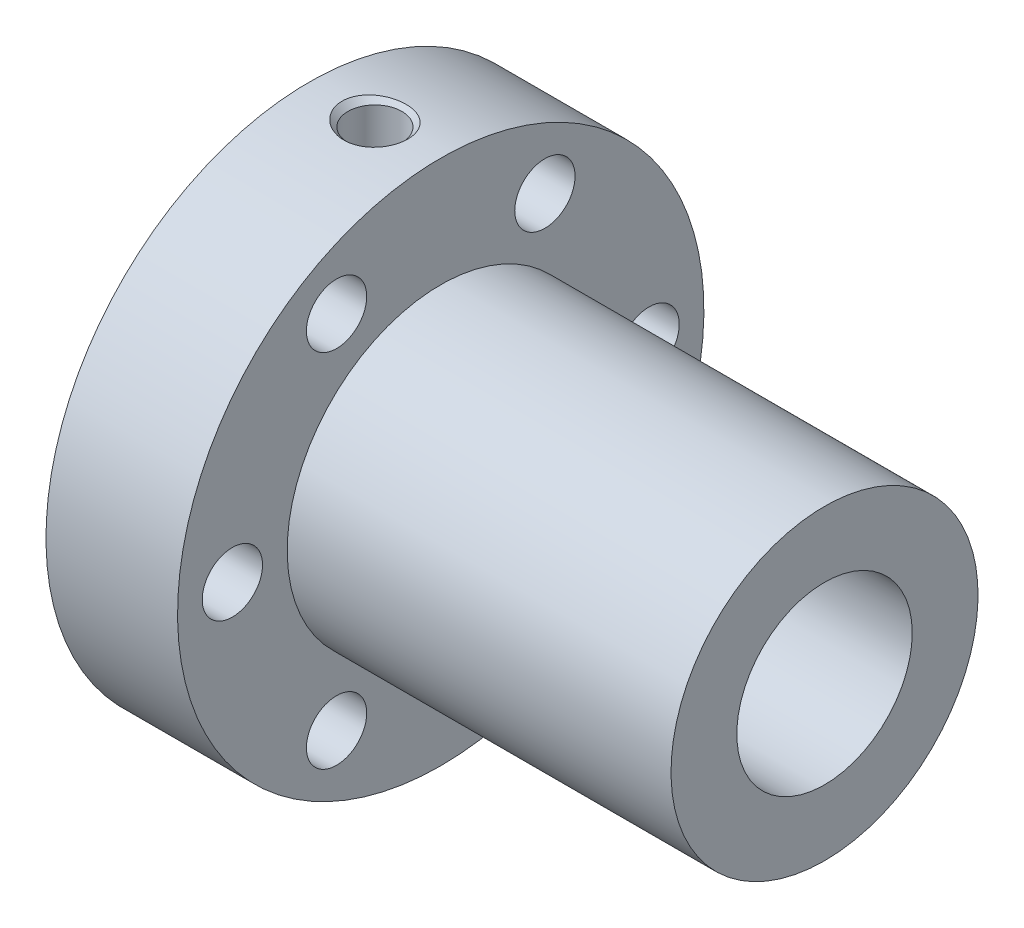
ISO-10303-21;
HEADER;
FILE_DESCRIPTION(('STEP AP214'),'2;1');
FILE_NAME('part.step','',(''),(''),'','','');
FILE_SCHEMA(('AUTOMOTIVE_DESIGN { 1 0 10303 214 1 1 1 1 }'));
ENDSEC;
DATA;
#1=APPLICATION_CONTEXT('core data for automotive mechanical design processes');
#2=APPLICATION_PROTOCOL_DEFINITION('international standard','automotive_design',2000,#1);
#3=PRODUCT_CONTEXT('',#1,'mechanical');
#4=PRODUCT('Part','Part','',(#3));
#5=PRODUCT_RELATED_PRODUCT_CATEGORY('part','',(#4));
#6=PRODUCT_DEFINITION_FORMATION('','',#4);
#7=PRODUCT_DEFINITION_CONTEXT('part definition',#1,'design');
#8=PRODUCT_DEFINITION('design','',#6,#7);
#9=PRODUCT_DEFINITION_SHAPE('','',#8);
#10=(LENGTH_UNIT() NAMED_UNIT(*) SI_UNIT(.MILLI.,.METRE.));
#11=(NAMED_UNIT(*) PLANE_ANGLE_UNIT() SI_UNIT($,.RADIAN.));
#12=(NAMED_UNIT(*) SI_UNIT($,.STERADIAN.) SOLID_ANGLE_UNIT());
#13=UNCERTAINTY_MEASURE_WITH_UNIT(LENGTH_MEASURE(1.E-05),#10,'distance_accuracy_value','');
#14=(GEOMETRIC_REPRESENTATION_CONTEXT(3) GLOBAL_UNCERTAINTY_ASSIGNED_CONTEXT((#13)) GLOBAL_UNIT_ASSIGNED_CONTEXT((#10,
#11,#12)) REPRESENTATION_CONTEXT('',''));
#15=CARTESIAN_POINT('',(0.,0.,0.));
#16=DIRECTION('',(0.,0.,1.));
#17=DIRECTION('',(1.,0.,0.));
#18=AXIS2_PLACEMENT_3D('',#15,#16,#17);
#19=CARTESIAN_POINT('',(0.,0.,0.));
#20=DIRECTION('',(1.,0.,0.));
#21=DIRECTION('',(0.,-1.,0.));
#22=AXIS2_PLACEMENT_3D('',#19,#20,#21);
#23=CYLINDRICAL_SURFACE('',#22,24.);
#24=CARTESIAN_POINT('',(0.,0.,0.));
#25=DIRECTION('',(1.,0.,0.));
#26=DIRECTION('',(0.,-1.,0.));
#27=AXIS2_PLACEMENT_3D('',#24,#25,#26);
#28=CIRCLE('',#27,24.);
#29=CARTESIAN_POINT('',(0.,-24.,0.));
#30=VERTEX_POINT('',#29);
#31=EDGE_CURVE('E50',#30,#30,#28,.T.);
#32=ORIENTED_EDGE('',*,*,#31,.T.);
#33=EDGE_LOOP('',(#32));
#34=FACE_BOUND('',#33,.T.);
#35=CARTESIAN_POINT('',(12.,0.,0.));
#36=DIRECTION('',(-1.,0.,0.));
#37=DIRECTION('',(0.,-1.,0.));
#38=AXIS2_PLACEMENT_3D('',#35,#36,#37);
#39=CIRCLE('',#38,24.);
#40=CARTESIAN_POINT('',(12.,-24.,0.));
#41=VERTEX_POINT('',#40);
#42=EDGE_CURVE('E42',#41,#41,#39,.T.);
#43=ORIENTED_EDGE('',*,*,#42,.T.);
#44=EDGE_LOOP('',(#43));
#45=FACE_BOUND('',#44,.T.);
#46=CARTESIAN_POINT('',(3.76391684699604,23.9257228568945,-1.8867395901363));
#47=CARTESIAN_POINT('',(3.86331419498613,23.9174459380795,-1.99170132171655));
#48=CARTESIAN_POINT('',(3.97059343258107,23.9090582079508,-2.08924536740158));
#49=CARTESIAN_POINT('',(4.19826068306872,23.8927857471194,-2.26778510726852));
#50=CARTESIAN_POINT('',(4.31866148579031,23.8849015192748,-2.34876443034583));
#51=CARTESIAN_POINT('',(4.58924497922088,23.8691699993858,-2.50394476853998));
#52=CARTESIAN_POINT('',(4.74115592822099,23.8615162940307,-2.575169632606));
#53=CARTESIAN_POINT('',(5.05453887096184,23.8485844304315,-2.69230498821142));
#54=CARTESIAN_POINT('',(5.21601392493858,23.8433070372356,-2.73820732829237));
#55=CARTESIAN_POINT('',(5.55068102131627,23.835532924454,-2.80509702852133));
#56=CARTESIAN_POINT('',(5.72408446760856,23.8331525132648,-2.82504435794665));
#57=CARTESIAN_POINT('',(6.07183156772308,23.8318212377608,-2.83625207811378));
#58=CARTESIAN_POINT('',(6.24617530569156,23.8328706856425,-2.82750985744269));
#59=CARTESIAN_POINT('',(6.59379815347542,23.8383267742707,-2.78113818398897));
#60=CARTESIAN_POINT('',(6.7670151523765,23.8427870836038,-2.74304686129607));
#61=CARTESIAN_POINT('',(7.10447299206432,23.8546141747167,-2.63820886796112));
#62=CARTESIAN_POINT('',(7.26871348751415,23.8619810682268,-2.57146109574442));
#63=CARTESIAN_POINT('',(7.58172192998061,23.8786713210721,-2.41152099590223));
#64=CARTESIAN_POINT('',(7.73062186482831,23.8879754594379,-2.31858551475884));
#65=CARTESIAN_POINT('',(8.0098728128916,23.9074653883956,-2.108132704326));
#66=CARTESIAN_POINT('',(8.14022698126301,23.917651028544,-1.99061956480947));
#67=CARTESIAN_POINT('',(8.37322639233879,23.9372483851758,-1.73880772272887));
#68=CARTESIAN_POINT('',(8.4767265186287,23.9466747997186,-1.60530246105032));
#69=CARTESIAN_POINT('',(8.65822249097971,23.9639894561574,-1.32185497171158));
#70=CARTESIAN_POINT('',(8.73622877772404,23.9718783271994,-1.1719195065133));
#71=CARTESIAN_POINT('',(8.85969436491406,23.9847010611652,-0.869300103448456));
#72=CARTESIAN_POINT('',(8.90679068100113,23.9897807921154,-0.717290045316438));
#73=CARTESIAN_POINT('',(8.97346273038677,23.9970435876175,-0.407292537812205));
#74=CARTESIAN_POINT('',(8.99304808471634,23.9992276648117,-0.249307197952175));
#75=CARTESIAN_POINT('',(9.00359231530273,24.0003991356173,0.0598759152359087));
#76=CARTESIAN_POINT('',(8.99590151745641,23.9995373255931,0.211028690781953));
#77=CARTESIAN_POINT('',(8.95518607704095,23.9950495721349,0.509823941736229));
#78=CARTESIAN_POINT('',(8.92216335236022,23.9914238379587,0.657466682017951));
#79=CARTESIAN_POINT('',(8.83240644833027,23.9818506497095,0.944074952399077));
#80=CARTESIAN_POINT('',(8.77584473429768,23.975920103015,1.08309531299346));
#81=CARTESIAN_POINT('',(8.64106035761519,23.9623691966673,1.35009580859378));
#82=CARTESIAN_POINT('',(8.56283462313796,23.9547485974055,1.47807437456221));
#83=CARTESIAN_POINT('',(8.38400938939949,23.9382919259864,1.72453253489149));
#84=CARTESIAN_POINT('',(8.28269073594915,23.9294213762047,1.84248727447393));
#85=CARTESIAN_POINT('',(8.06263447098894,23.9116092594528,2.0608174458583));
#86=CARTESIAN_POINT('',(7.94389250000047,23.9026676752402,2.16118846421743));
#87=CARTESIAN_POINT('',(7.68511084645979,23.8851058264209,2.3475511980975));
#88=CARTESIAN_POINT('',(7.5442432401542,23.8765328845422,2.4323980296057));
#89=CARTESIAN_POINT('',(7.25070267394519,23.8611906785646,2.57856485500606));
#90=CARTESIAN_POINT('',(7.0980268906929,23.8544218475616,2.63987920122836));
#91=CARTESIAN_POINT('',(6.77728188306257,23.8431129596703,2.74019341961034));
#92=CARTESIAN_POINT('',(6.60882530569173,23.8386964590099,2.77797133165445));
#93=CARTESIAN_POINT('',(6.267953475624,23.833093329546,2.82563985914353));
#94=CARTESIAN_POINT('',(6.09553760379916,23.831907209404,2.83552608272117));
#95=CARTESIAN_POINT('',(5.74717391360484,23.8329078360084,2.82710644062051));
#96=CARTESIAN_POINT('',(5.57124261416696,23.8351776212372,2.80810651490324));
#97=CARTESIAN_POINT('',(5.22507338074844,23.84298625117,2.74100961096882));
#98=CARTESIAN_POINT('',(5.05483582101805,23.8485253103194,2.69291072402414));
#99=CARTESIAN_POINT('',(4.72520419977209,23.8622236713232,2.5686889999146));
#100=CARTESIAN_POINT('',(4.56579885278119,23.8703801938537,2.49259587562005));
#101=CARTESIAN_POINT('',(4.26257616113656,23.8883492703173,2.31404120143319));
#102=CARTESIAN_POINT('',(4.11875747177995,23.8981616812054,2.21158192879713));
#103=CARTESIAN_POINT('',(3.85535747737402,23.9179504419751,1.98596900174524));
#104=CARTESIAN_POINT('',(3.73520810239316,23.9279144123701,1.86347867987729));
#105=CARTESIAN_POINT('',(3.51860696616715,23.9470392754778,1.59900734138117));
#106=CARTESIAN_POINT('',(3.42214696088309,23.9562004468534,1.45703313214758));
#107=CARTESIAN_POINT('',(3.26131547613242,23.9720890974789,1.16577619859283));
#108=CARTESIAN_POINT('',(3.19549431030372,23.978921161035,1.01730023453977));
#109=CARTESIAN_POINT('',(3.0912990955108,23.9899565467131,0.710927622051946));
#110=CARTESIAN_POINT('',(3.05291318738257,23.9941610045452,0.553035076045099));
#111=CARTESIAN_POINT('',(3.00661410277027,23.9992568389206,0.241900559673097));
#112=CARTESIAN_POINT('',(2.99710737526105,24.0003213725089,0.0888970354012509));
#113=CARTESIAN_POINT('',(3.00441884606696,23.9995090683811,-0.216480915990946));
#114=CARTESIAN_POINT('',(3.02123636364723,23.9976323067259,-0.368855359276925));
#115=CARTESIAN_POINT('',(3.07982192273524,23.9912312484015,-0.665061665167081));
#116=CARTESIAN_POINT('',(3.12102014521809,23.9867674627056,-0.809008590920217));
#117=CARTESIAN_POINT('',(3.22633435668321,23.9757287229279,-1.0880838318749));
#118=CARTESIAN_POINT('',(3.29043700022503,23.9691549984449,-1.22321722824278));
#119=CARTESIAN_POINT('',(3.42053510557518,23.9564226009525,-1.44886815366357));
#120=CARTESIAN_POINT('',(3.48199809661331,23.950575497033,-1.54205785663257));
#121=CARTESIAN_POINT('',(3.61538744960445,23.9384150798511,-1.72054563348173));
#122=CARTESIAN_POINT('',(3.68731131191963,23.9321018781403,-1.80584558468404));
#123=CARTESIAN_POINT('',(3.76391684699604,23.9257228568945,-1.8867395901363));
#124=B_SPLINE_CURVE_WITH_KNOTS('',3,(#46,#47,#48,#49,#50,#51,#52,#53,#54,#55,#56,#57,#58,#59,
#60,#61,#62,#63,#64,#65,#66,#67,#68,#69,#70,#71,#72,#73,#74,#75,#76,#77,#78,#79,#80,#81,#82,#83,
#84,#85,#86,#87,#88,#89,#90,#91,#92,#93,#94,#95,#96,#97,#98,#99,#100,#101,#102,#103,#104,#105,
#106,#107,#108,#109,#110,#111,#112,#113,#114,#115,#116,#117,#118,#119,#120,#121,#122,#123),
.UNSPECIFIED.,.T.,.F.,(4,2,2,2,2,2,2,2,2,2,2,2,2,2,2,2,2,2,2,2,2,2,2,2,2,2,2,2,2,2,2,2,2,2,2,2,
2,2,4),(0.,0.434065938349172,0.86855881812712,1.37012489060537,1.87185232586216,
2.39312122935873,2.91443758170307,3.44412984265685,3.97384246718786,4.49853048273278,
5.02312912709225,5.52808136611259,6.03282654836,6.50804469869781,6.98309661610401,
7.43496608684069,7.88680134976926,8.33538282072525,8.78402793042133,9.24923007733297,
9.71454882132754,10.2063755641544,10.6983202690541,11.2140456122984,11.7298521579018,
12.2582495494264,12.7866816045944,13.3145543965752,13.8423816112362,14.3553585750311,
14.868156766073,15.3533068263983,15.8382470487262,16.2958924119657,16.7535259408673,
17.2008641685546,17.6479421750129,17.982556614808,18.3170912290413),.UNSPECIFIED.);
#125=CARTESIAN_POINT('',(3.76391684699604,23.9257228568945,-1.8867395901363));
#126=VERTEX_POINT('',#125);
#127=EDGE_CURVE('E12',#126,#126,#124,.T.);
#128=ORIENTED_EDGE('',*,*,#127,.T.);
#129=EDGE_LOOP('',(#128));
#130=FACE_BOUND('',#129,.T.);
#131=ADVANCED_FACE('F22',(#34,#45,#130),#23,.T.);
#132=CARTESIAN_POINT('',(12.,0.,0.));
#133=DIRECTION('',(1.,0.,0.));
#134=DIRECTION('',(0.,0.,-1.));
#135=AXIS2_PLACEMENT_3D('',#132,#133,#134);
#136=PLANE('',#135);
#137=CARTESIAN_POINT('',(12.,16.4544826719044,-9.5));
#138=DIRECTION('',(1.,0.,0.));
#139=DIRECTION('',(0.,0.,-1.));
#140=AXIS2_PLACEMENT_3D('',#137,#138,#139);
#141=CIRCLE('',#140,2.75);
#142=CARTESIAN_POINT('',(12.,16.4544826719044,-12.25));
#143=VERTEX_POINT('',#142);
#144=EDGE_CURVE('E88',#143,#143,#141,.T.);
#145=ORIENTED_EDGE('',*,*,#144,.F.);
#146=EDGE_LOOP('',(#145));
#147=FACE_BOUND('',#146,.T.);
#148=CARTESIAN_POINT('',(12.,0.,-19.));
#149=DIRECTION('',(1.,0.,0.));
#150=DIRECTION('',(0.,0.,-1.));
#151=AXIS2_PLACEMENT_3D('',#148,#149,#150);
#152=CIRCLE('',#151,2.75);
#153=CARTESIAN_POINT('',(12.,0.,-21.75));
#154=VERTEX_POINT('',#153);
#155=EDGE_CURVE('E84',#154,#154,#152,.T.);
#156=ORIENTED_EDGE('',*,*,#155,.F.);
#157=EDGE_LOOP('',(#156));
#158=FACE_BOUND('',#157,.T.);
#159=CARTESIAN_POINT('',(12.,-16.4544826719044,-9.5));
#160=DIRECTION('',(1.,0.,0.));
#161=DIRECTION('',(0.,0.,-1.));
#162=AXIS2_PLACEMENT_3D('',#159,#160,#161);
#163=CIRCLE('',#162,2.75);
#164=CARTESIAN_POINT('',(12.,-16.4544826719044,-12.25));
#165=VERTEX_POINT('',#164);
#166=EDGE_CURVE('E79',#165,#165,#163,.T.);
#167=ORIENTED_EDGE('',*,*,#166,.F.);
#168=EDGE_LOOP('',(#167));
#169=FACE_BOUND('',#168,.T.);
#170=CARTESIAN_POINT('',(12.,-16.4544826719044,9.5));
#171=DIRECTION('',(1.,0.,0.));
#172=DIRECTION('',(0.,0.,-1.));
#173=AXIS2_PLACEMENT_3D('',#170,#171,#172);
#174=CIRCLE('',#173,2.75);
#175=CARTESIAN_POINT('',(12.,-16.4544826719044,6.75));
#176=VERTEX_POINT('',#175);
#177=EDGE_CURVE('E74',#176,#176,#174,.T.);
#178=ORIENTED_EDGE('',*,*,#177,.F.);
#179=EDGE_LOOP('',(#178));
#180=FACE_BOUND('',#179,.T.);
#181=CARTESIAN_POINT('',(12.,0.,19.));
#182=DIRECTION('',(1.,0.,0.));
#183=DIRECTION('',(0.,0.,-1.));
#184=AXIS2_PLACEMENT_3D('',#181,#182,#183);
#185=CIRCLE('',#184,2.75);
#186=CARTESIAN_POINT('',(12.,0.,16.25));
#187=VERTEX_POINT('',#186);
#188=EDGE_CURVE('E69',#187,#187,#185,.T.);
#189=ORIENTED_EDGE('',*,*,#188,.F.);
#190=EDGE_LOOP('',(#189));
#191=FACE_BOUND('',#190,.T.);
#192=CARTESIAN_POINT('',(12.,16.4544826719044,9.5));
#193=DIRECTION('',(1.,0.,0.));
#194=DIRECTION('',(0.,0.,-1.));
#195=AXIS2_PLACEMENT_3D('',#192,#193,#194);
#196=CIRCLE('',#195,2.75);
#197=CARTESIAN_POINT('',(12.,16.4544826719044,6.75));
#198=VERTEX_POINT('',#197);
#199=EDGE_CURVE('E64',#198,#198,#196,.T.);
#200=ORIENTED_EDGE('',*,*,#199,.F.);
#201=EDGE_LOOP('',(#200));
#202=FACE_BOUND('',#201,.T.);
#203=CARTESIAN_POINT('',(12.,0.,0.));
#204=DIRECTION('',(1.,0.,0.));
#205=DIRECTION('',(0.,0.,-1.));
#206=AXIS2_PLACEMENT_3D('',#203,#204,#205);
#207=CIRCLE('',#206,14.);
#208=CARTESIAN_POINT('',(12.,0.,-14.));
#209=VERTEX_POINT('',#208);
#210=EDGE_CURVE('E33',#209,#209,#207,.T.);
#211=ORIENTED_EDGE('',*,*,#210,.F.);
#212=EDGE_LOOP('',(#211));
#213=FACE_BOUND('',#212,.T.);
#214=ORIENTED_EDGE('',*,*,#42,.F.);
#215=EDGE_LOOP('',(#214));
#216=FACE_BOUND('',#215,.T.);
#217=ADVANCED_FACE('F151',(#147,#158,#169,#180,#191,#202,#213,#216),#136,.T.);
#218=CARTESIAN_POINT('',(0.,0.,0.));
#219=DIRECTION('',(-1.,0.,0.));
#220=DIRECTION('',(0.,0.,1.));
#221=AXIS2_PLACEMENT_3D('',#218,#219,#220);
#222=PLANE('',#221);
#223=CARTESIAN_POINT('',(0.,16.4544826719044,-9.5));
#224=DIRECTION('',(-1.,0.,0.));
#225=DIRECTION('',(0.,0.,1.));
#226=AXIS2_PLACEMENT_3D('',#223,#224,#225);
#227=CIRCLE('',#226,2.75);
#228=CARTESIAN_POINT('',(0.,16.4544826719044,-6.75));
#229=VERTEX_POINT('',#228);
#230=EDGE_CURVE('E89',#229,#229,#227,.T.);
#231=ORIENTED_EDGE('',*,*,#230,.F.);
#232=EDGE_LOOP('',(#231));
#233=FACE_BOUND('',#232,.T.);
#234=CARTESIAN_POINT('',(0.,0.,-19.));
#235=DIRECTION('',(-1.,0.,0.));
#236=DIRECTION('',(0.,0.,1.));
#237=AXIS2_PLACEMENT_3D('',#234,#235,#236);
#238=CIRCLE('',#237,2.75);
#239=CARTESIAN_POINT('',(0.,0.,-16.25));
#240=VERTEX_POINT('',#239);
#241=EDGE_CURVE('E85',#240,#240,#238,.T.);
#242=ORIENTED_EDGE('',*,*,#241,.F.);
#243=EDGE_LOOP('',(#242));
#244=FACE_BOUND('',#243,.T.);
#245=CARTESIAN_POINT('',(0.,-16.4544826719044,-9.5));
#246=DIRECTION('',(-1.,0.,0.));
#247=DIRECTION('',(0.,0.,1.));
#248=AXIS2_PLACEMENT_3D('',#245,#246,#247);
#249=CIRCLE('',#248,2.75);
#250=CARTESIAN_POINT('',(0.,-16.4544826719044,-6.75));
#251=VERTEX_POINT('',#250);
#252=EDGE_CURVE('E80',#251,#251,#249,.T.);
#253=ORIENTED_EDGE('',*,*,#252,.F.);
#254=EDGE_LOOP('',(#253));
#255=FACE_BOUND('',#254,.T.);
#256=CARTESIAN_POINT('',(0.,-16.4544826719044,9.5));
#257=DIRECTION('',(-1.,0.,0.));
#258=DIRECTION('',(0.,0.,1.));
#259=AXIS2_PLACEMENT_3D('',#256,#257,#258);
#260=CIRCLE('',#259,2.75);
#261=CARTESIAN_POINT('',(0.,-16.4544826719044,12.25));
#262=VERTEX_POINT('',#261);
#263=EDGE_CURVE('E75',#262,#262,#260,.T.);
#264=ORIENTED_EDGE('',*,*,#263,.F.);
#265=EDGE_LOOP('',(#264));
#266=FACE_BOUND('',#265,.T.);
#267=CARTESIAN_POINT('',(0.,0.,19.));
#268=DIRECTION('',(-1.,0.,0.));
#269=DIRECTION('',(0.,0.,1.));
#270=AXIS2_PLACEMENT_3D('',#267,#268,#269);
#271=CIRCLE('',#270,2.75);
#272=CARTESIAN_POINT('',(0.,0.,21.75));
#273=VERTEX_POINT('',#272);
#274=EDGE_CURVE('E70',#273,#273,#271,.T.);
#275=ORIENTED_EDGE('',*,*,#274,.F.);
#276=EDGE_LOOP('',(#275));
#277=FACE_BOUND('',#276,.T.);
#278=CARTESIAN_POINT('',(0.,16.4544826719044,9.5));
#279=DIRECTION('',(-1.,0.,0.));
#280=DIRECTION('',(0.,0.,1.));
#281=AXIS2_PLACEMENT_3D('',#278,#279,#280);
#282=CIRCLE('',#281,2.75);
#283=CARTESIAN_POINT('',(0.,16.4544826719044,12.25));
#284=VERTEX_POINT('',#283);
#285=EDGE_CURVE('E65',#284,#284,#282,.T.);
#286=ORIENTED_EDGE('',*,*,#285,.F.);
#287=EDGE_LOOP('',(#286));
#288=FACE_BOUND('',#287,.T.);
#289=CARTESIAN_POINT('',(0.,0.,0.));
#290=DIRECTION('',(-1.,0.,0.));
#291=DIRECTION('',(0.,0.,1.));
#292=AXIS2_PLACEMENT_3D('',#289,#290,#291);
#293=CIRCLE('',#292,8.);
#294=CARTESIAN_POINT('',(0.,0.,8.));
#295=VERTEX_POINT('',#294);
#296=EDGE_CURVE('E63',#295,#295,#293,.T.);
#297=ORIENTED_EDGE('',*,*,#296,.F.);
#298=EDGE_LOOP('',(#297));
#299=FACE_BOUND('',#298,.T.);
#300=ORIENTED_EDGE('',*,*,#31,.F.);
#301=EDGE_LOOP('',(#300));
#302=FACE_BOUND('',#301,.T.);
#303=ADVANCED_FACE('F141',(#233,#244,#255,#266,#277,#288,#299,#302),#222,.T.);
#304=CARTESIAN_POINT('',(47.,0.,0.));
#305=DIRECTION('',(1.,0.,0.));
#306=DIRECTION('',(0.,0.,-1.));
#307=AXIS2_PLACEMENT_3D('',#304,#305,#306);
#308=PLANE('',#307);
#309=CARTESIAN_POINT('',(47.,0.,0.));
#310=DIRECTION('',(1.,0.,0.));
#311=DIRECTION('',(0.,0.,-1.));
#312=AXIS2_PLACEMENT_3D('',#309,#310,#311);
#313=CIRCLE('',#312,8.);
#314=CARTESIAN_POINT('',(47.,0.,-8.));
#315=VERTEX_POINT('',#314);
#316=EDGE_CURVE('E59',#315,#315,#313,.T.);
#317=ORIENTED_EDGE('',*,*,#316,.F.);
#318=EDGE_LOOP('',(#317));
#319=FACE_BOUND('',#318,.T.);
#320=CARTESIAN_POINT('',(47.,0.,0.));
#321=DIRECTION('',(-1.,0.,0.));
#322=DIRECTION('',(0.,-1.,0.));
#323=AXIS2_PLACEMENT_3D('',#320,#321,#322);
#324=CIRCLE('',#323,14.);
#325=CARTESIAN_POINT('',(47.,-14.,0.));
#326=VERTEX_POINT('',#325);
#327=EDGE_CURVE('E54',#326,#326,#324,.T.);
#328=ORIENTED_EDGE('',*,*,#327,.F.);
#329=EDGE_LOOP('',(#328));
#330=FACE_BOUND('',#329,.T.);
#331=ADVANCED_FACE('F139',(#319,#330),#308,.T.);
#332=CARTESIAN_POINT('',(0.,0.,0.));
#333=DIRECTION('',(1.,0.,0.));
#334=DIRECTION('',(0.,-1.,0.));
#335=AXIS2_PLACEMENT_3D('',#332,#333,#334);
#336=CYLINDRICAL_SURFACE('',#335,14.);
#337=ORIENTED_EDGE('',*,*,#210,.T.);
#338=EDGE_LOOP('',(#337));
#339=FACE_BOUND('',#338,.T.);
#340=ORIENTED_EDGE('',*,*,#327,.T.);
#341=EDGE_LOOP('',(#340));
#342=FACE_BOUND('',#341,.T.);
#343=ADVANCED_FACE('F137',(#339,#342),#336,.T.);
#344=CARTESIAN_POINT('',(-1.,0.,0.));
#345=DIRECTION('',(1.,0.,0.));
#346=DIRECTION('',(0.,-1.,0.));
#347=AXIS2_PLACEMENT_3D('',#344,#345,#346);
#348=CYLINDRICAL_SURFACE('',#347,8.);
#349=ORIENTED_EDGE('',*,*,#296,.T.);
#350=EDGE_LOOP('',(#349));
#351=FACE_BOUND('',#350,.T.);
#352=ORIENTED_EDGE('',*,*,#316,.T.);
#353=EDGE_LOOP('',(#352));
#354=FACE_BOUND('',#353,.T.);
#355=ADVANCED_FACE('F149',(#351,#354),#348,.F.);
#356=CARTESIAN_POINT('',(-1.,16.4544826719044,9.5));
#357=DIRECTION('',(1.,0.,0.));
#358=DIRECTION('',(0.,-0.866025403784439,-0.5));
#359=AXIS2_PLACEMENT_3D('',#356,#357,#358);
#360=CYLINDRICAL_SURFACE('',#359,2.75);
#361=ORIENTED_EDGE('',*,*,#199,.T.);
#362=EDGE_LOOP('',(#361));
#363=FACE_BOUND('',#362,.T.);
#364=ORIENTED_EDGE('',*,*,#285,.T.);
#365=EDGE_LOOP('',(#364));
#366=FACE_BOUND('',#365,.T.);
#367=ADVANCED_FACE('F182',(#363,#366),#360,.F.);
#368=CARTESIAN_POINT('',(-1.,0.,19.));
#369=DIRECTION('',(1.,0.,0.));
#370=DIRECTION('',(0.,0.,-1.));
#371=AXIS2_PLACEMENT_3D('',#368,#369,#370);
#372=CYLINDRICAL_SURFACE('',#371,2.75);
#373=ORIENTED_EDGE('',*,*,#188,.T.);
#374=EDGE_LOOP('',(#373));
#375=FACE_BOUND('',#374,.T.);
#376=ORIENTED_EDGE('',*,*,#274,.T.);
#377=EDGE_LOOP('',(#376));
#378=FACE_BOUND('',#377,.T.);
#379=ADVANCED_FACE('F185',(#375,#378),#372,.F.);
#380=CARTESIAN_POINT('',(-1.,-16.4544826719044,9.5));
#381=DIRECTION('',(1.,0.,0.));
#382=DIRECTION('',(0.,0.866025403784439,-0.5));
#383=AXIS2_PLACEMENT_3D('',#380,#381,#382);
#384=CYLINDRICAL_SURFACE('',#383,2.75);
#385=ORIENTED_EDGE('',*,*,#177,.T.);
#386=EDGE_LOOP('',(#385));
#387=FACE_BOUND('',#386,.T.);
#388=ORIENTED_EDGE('',*,*,#263,.T.);
#389=EDGE_LOOP('',(#388));
#390=FACE_BOUND('',#389,.T.);
#391=ADVANCED_FACE('F194',(#387,#390),#384,.F.);
#392=CARTESIAN_POINT('',(-1.,-16.4544826719044,-9.5));
#393=DIRECTION('',(1.,0.,0.));
#394=DIRECTION('',(0.,0.866025403784439,0.5));
#395=AXIS2_PLACEMENT_3D('',#392,#393,#394);
#396=CYLINDRICAL_SURFACE('',#395,2.75);
#397=ORIENTED_EDGE('',*,*,#166,.T.);
#398=EDGE_LOOP('',(#397));
#399=FACE_BOUND('',#398,.T.);
#400=ORIENTED_EDGE('',*,*,#252,.T.);
#401=EDGE_LOOP('',(#400));
#402=FACE_BOUND('',#401,.T.);
#403=ADVANCED_FACE('F200',(#399,#402),#396,.F.);
#404=CARTESIAN_POINT('',(-1.,0.,-19.));
#405=DIRECTION('',(1.,0.,0.));
#406=DIRECTION('',(0.,0.,1.));
#407=AXIS2_PLACEMENT_3D('',#404,#405,#406);
#408=CYLINDRICAL_SURFACE('',#407,2.75);
#409=ORIENTED_EDGE('',*,*,#155,.T.);
#410=EDGE_LOOP('',(#409));
#411=FACE_BOUND('',#410,.T.);
#412=ORIENTED_EDGE('',*,*,#241,.T.);
#413=EDGE_LOOP('',(#412));
#414=FACE_BOUND('',#413,.T.);
#415=ADVANCED_FACE('F204',(#411,#414),#408,.F.);
#416=CARTESIAN_POINT('',(-1.,16.4544826719044,-9.5));
#417=DIRECTION('',(1.,0.,0.));
#418=DIRECTION('',(0.,-0.866025403784438,0.5));
#419=AXIS2_PLACEMENT_3D('',#416,#417,#418);
#420=CYLINDRICAL_SURFACE('',#419,2.75);
#421=ORIENTED_EDGE('',*,*,#144,.T.);
#422=EDGE_LOOP('',(#421));
#423=FACE_BOUND('',#422,.T.);
#424=ORIENTED_EDGE('',*,*,#230,.T.);
#425=EDGE_LOOP('',(#424));
#426=FACE_BOUND('',#425,.T.);
#427=ADVANCED_FACE('F208',(#423,#426),#420,.F.);
#428=CARTESIAN_POINT('',(6.,16.,0.));
#429=DIRECTION('',(0.,1.,0.));
#430=DIRECTION('',(0.,0.,1.));
#431=AXIS2_PLACEMENT_3D('',#428,#429,#430);
#432=PLANE('',#431);
#433=CARTESIAN_POINT('',(6.,16.,0.));
#434=DIRECTION('',(0.,1.,0.));
#435=DIRECTION('',(0.,0.,1.));
#436=AXIS2_PLACEMENT_3D('',#433,#434,#435);
#437=CIRCLE('',#436,2.45875);
#438=CARTESIAN_POINT('',(6.,16.,2.45875));
#439=VERTEX_POINT('',#438);
#440=EDGE_CURVE('E92',#439,#439,#437,.T.);
#441=ORIENTED_EDGE('',*,*,#440,.T.);
#442=EDGE_LOOP('',(#441));
#443=FACE_BOUND('',#442,.T.);
#444=ADVANCED_FACE('F212',(#443),#432,.T.);
#445=CARTESIAN_POINT('',(6.,25.,0.));
#446=DIRECTION('',(0.,1.,0.));
#447=DIRECTION('',(0.,0.,1.));
#448=AXIS2_PLACEMENT_3D('',#445,#446,#447);
#449=CYLINDRICAL_SURFACE('',#448,2.45875);
#450=CARTESIAN_POINT('',(6.,23.45875,0.));
#451=DIRECTION('',(0.,1.,0.));
#452=DIRECTION('',(0.,0.,1.));
#453=AXIS2_PLACEMENT_3D('',#450,#451,#452);
#454=CIRCLE('',#453,2.45875);
#455=CARTESIAN_POINT('',(6.,23.45875,2.45875));
#456=VERTEX_POINT('',#455);
#457=EDGE_CURVE('E101',#456,#456,#454,.T.);
#458=ORIENTED_EDGE('',*,*,#457,.T.);
#459=EDGE_LOOP('',(#458));
#460=FACE_BOUND('',#459,.T.);
#461=ORIENTED_EDGE('',*,*,#440,.F.);
#462=EDGE_LOOP('',(#461));
#463=FACE_BOUND('',#462,.T.);
#464=ADVANCED_FACE('F216',(#460,#463),#449,.F.);
#465=CARTESIAN_POINT('',(6.,23.45875,0.));
#466=DIRECTION('',(0.,1.,0.));
#467=DIRECTION('',(0.,0.,1.));
#468=AXIS2_PLACEMENT_3D('',#465,#466,#467);
#469=CONICAL_SURFACE('',#468,2.45875,0.785398163397449);
#470=ORIENTED_EDGE('',*,*,#127,.F.);
#471=EDGE_LOOP('',(#470));
#472=FACE_BOUND('',#471,.T.);
#473=ORIENTED_EDGE('',*,*,#457,.F.);
#474=EDGE_LOOP('',(#473));
#475=FACE_BOUND('',#474,.T.);
#476=ADVANCED_FACE('F218',(#472,#475),#469,.F.);
#477=CLOSED_SHELL('',(#131,#217,#303,#331,#343,#355,#367,#379,#391,#403,#415,#427,#444,#464,#476));
#478=MANIFOLD_SOLID_BREP('B1',#477);
#479=ADVANCED_BREP_SHAPE_REPRESENTATION('',(#18,#478),#14);
#480=SHAPE_DEFINITION_REPRESENTATION(#9,#479);
ENDSEC;
END-ISO-10303-21;
